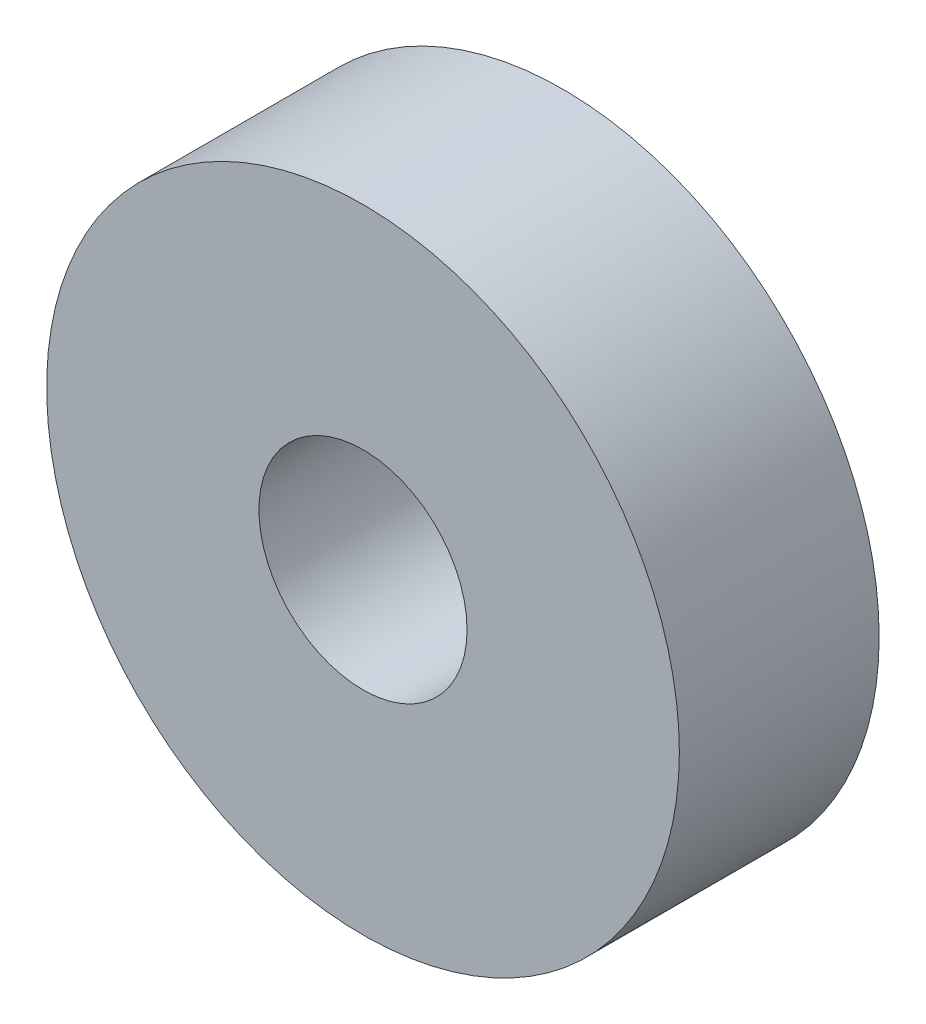
ISO-10303-21;
HEADER;
FILE_DESCRIPTION(('STEP AP214'),'2;1');
FILE_NAME('part.step','',(''),(''),'','','');
FILE_SCHEMA(('AUTOMOTIVE_DESIGN { 1 0 10303 214 1 1 1 1 }'));
ENDSEC;
DATA;
#1=APPLICATION_CONTEXT('core data for automotive mechanical design processes');
#2=APPLICATION_PROTOCOL_DEFINITION('international standard','automotive_design',2000,#1);
#3=PRODUCT_CONTEXT('',#1,'mechanical');
#4=PRODUCT('Part','Part','',(#3));
#5=PRODUCT_RELATED_PRODUCT_CATEGORY('part','',(#4));
#6=PRODUCT_DEFINITION_FORMATION('','',#4);
#7=PRODUCT_DEFINITION_CONTEXT('part definition',#1,'design');
#8=PRODUCT_DEFINITION('design','',#6,#7);
#9=PRODUCT_DEFINITION_SHAPE('','',#8);
#10=(LENGTH_UNIT() NAMED_UNIT(*) SI_UNIT(.MILLI.,.METRE.));
#11=(NAMED_UNIT(*) PLANE_ANGLE_UNIT() SI_UNIT($,.RADIAN.));
#12=(NAMED_UNIT(*) SI_UNIT($,.STERADIAN.) SOLID_ANGLE_UNIT());
#13=UNCERTAINTY_MEASURE_WITH_UNIT(LENGTH_MEASURE(1.E-05),#10,'distance_accuracy_value','');
#14=(GEOMETRIC_REPRESENTATION_CONTEXT(3) GLOBAL_UNCERTAINTY_ASSIGNED_CONTEXT((#13)) GLOBAL_UNIT_ASSIGNED_CONTEXT((#10,
#11,#12)) REPRESENTATION_CONTEXT('',''));
#15=CARTESIAN_POINT('',(0.,0.,0.));
#16=DIRECTION('',(0.,0.,1.));
#17=DIRECTION('',(1.,0.,0.));
#18=AXIS2_PLACEMENT_3D('',#15,#16,#17);
#19=CARTESIAN_POINT('',(0.,0.,6.));
#20=DIRECTION('',(0.,0.,1.));
#21=DIRECTION('',(1.,0.,0.));
#22=AXIS2_PLACEMENT_3D('',#19,#20,#21);
#23=PLANE('',#22);
#24=CARTESIAN_POINT('',(0.,0.,6.));
#25=DIRECTION('',(0.,0.,1.));
#26=DIRECTION('',(1.,0.,0.));
#27=AXIS2_PLACEMENT_3D('',#24,#25,#26);
#28=CIRCLE('',#27,9.5);
#29=CARTESIAN_POINT('',(9.5,0.,6.));
#30=VERTEX_POINT('',#29);
#31=EDGE_CURVE('E10',#30,#30,#28,.T.);
#32=ORIENTED_EDGE('',*,*,#31,.T.);
#33=EDGE_LOOP('',(#32));
#34=FACE_BOUND('',#33,.T.);
#35=CARTESIAN_POINT('',(0.,0.,6.));
#36=DIRECTION('',(0.,0.,1.));
#37=DIRECTION('',(1.,0.,0.));
#38=AXIS2_PLACEMENT_3D('',#35,#36,#37);
#39=CIRCLE('',#38,3.125);
#40=CARTESIAN_POINT('',(3.125,0.,6.));
#41=VERTEX_POINT('',#40);
#42=EDGE_CURVE('E50',#41,#41,#39,.T.);
#43=ORIENTED_EDGE('',*,*,#42,.F.);
#44=EDGE_LOOP('',(#43));
#45=FACE_BOUND('',#44,.T.);
#46=ADVANCED_FACE('F37',(#34,#45),#23,.T.);
#47=CARTESIAN_POINT('',(0.,0.,0.));
#48=DIRECTION('',(0.,0.,1.));
#49=DIRECTION('',(1.,0.,0.));
#50=AXIS2_PLACEMENT_3D('',#47,#48,#49);
#51=PLANE('',#50);
#52=CARTESIAN_POINT('',(0.,0.,0.));
#53=DIRECTION('',(0.,0.,1.));
#54=DIRECTION('',(1.,0.,0.));
#55=AXIS2_PLACEMENT_3D('',#52,#53,#54);
#56=CIRCLE('',#55,9.5);
#57=CARTESIAN_POINT('',(9.5,0.,0.));
#58=VERTEX_POINT('',#57);
#59=EDGE_CURVE('E41',#58,#58,#56,.T.);
#60=ORIENTED_EDGE('',*,*,#59,.F.);
#61=EDGE_LOOP('',(#60));
#62=FACE_BOUND('',#61,.T.);
#63=CARTESIAN_POINT('',(0.,0.,0.));
#64=DIRECTION('',(0.,0.,1.));
#65=DIRECTION('',(1.,0.,0.));
#66=AXIS2_PLACEMENT_3D('',#63,#64,#65);
#67=CIRCLE('',#66,3.125);
#68=CARTESIAN_POINT('',(3.125,0.,0.));
#69=VERTEX_POINT('',#68);
#70=EDGE_CURVE('E52',#69,#69,#67,.T.);
#71=ORIENTED_EDGE('',*,*,#70,.T.);
#72=EDGE_LOOP('',(#71));
#73=FACE_BOUND('',#72,.T.);
#74=ADVANCED_FACE('F64',(#62,#73),#51,.F.);
#75=CARTESIAN_POINT('',(0.,0.,6.));
#76=DIRECTION('',(0.,0.,-1.));
#77=DIRECTION('',(-1.,0.,0.));
#78=AXIS2_PLACEMENT_3D('',#75,#76,#77);
#79=CYLINDRICAL_SURFACE('',#78,9.5);
#80=ORIENTED_EDGE('',*,*,#31,.F.);
#81=EDGE_LOOP('',(#80));
#82=FACE_BOUND('',#81,.T.);
#83=ORIENTED_EDGE('',*,*,#59,.T.);
#84=EDGE_LOOP('',(#83));
#85=FACE_BOUND('',#84,.T.);
#86=ADVANCED_FACE('F39',(#82,#85),#79,.T.);
#87=CARTESIAN_POINT('',(0.,0.,6.));
#88=DIRECTION('',(0.,0.,-1.));
#89=DIRECTION('',(-1.,0.,0.));
#90=AXIS2_PLACEMENT_3D('',#87,#88,#89);
#91=CYLINDRICAL_SURFACE('',#90,3.125);
#92=ORIENTED_EDGE('',*,*,#42,.T.);
#93=EDGE_LOOP('',(#92));
#94=FACE_BOUND('',#93,.T.);
#95=ORIENTED_EDGE('',*,*,#70,.F.);
#96=EDGE_LOOP('',(#95));
#97=FACE_BOUND('',#96,.T.);
#98=ADVANCED_FACE('F60',(#94,#97),#91,.F.);
#99=CLOSED_SHELL('',(#46,#74,#86,#98));
#100=MANIFOLD_SOLID_BREP('B2',#99);
#101=ADVANCED_BREP_SHAPE_REPRESENTATION('',(#18,#100),#14);
#102=SHAPE_DEFINITION_REPRESENTATION(#9,#101);
ENDSEC;
END-ISO-10303-21;
